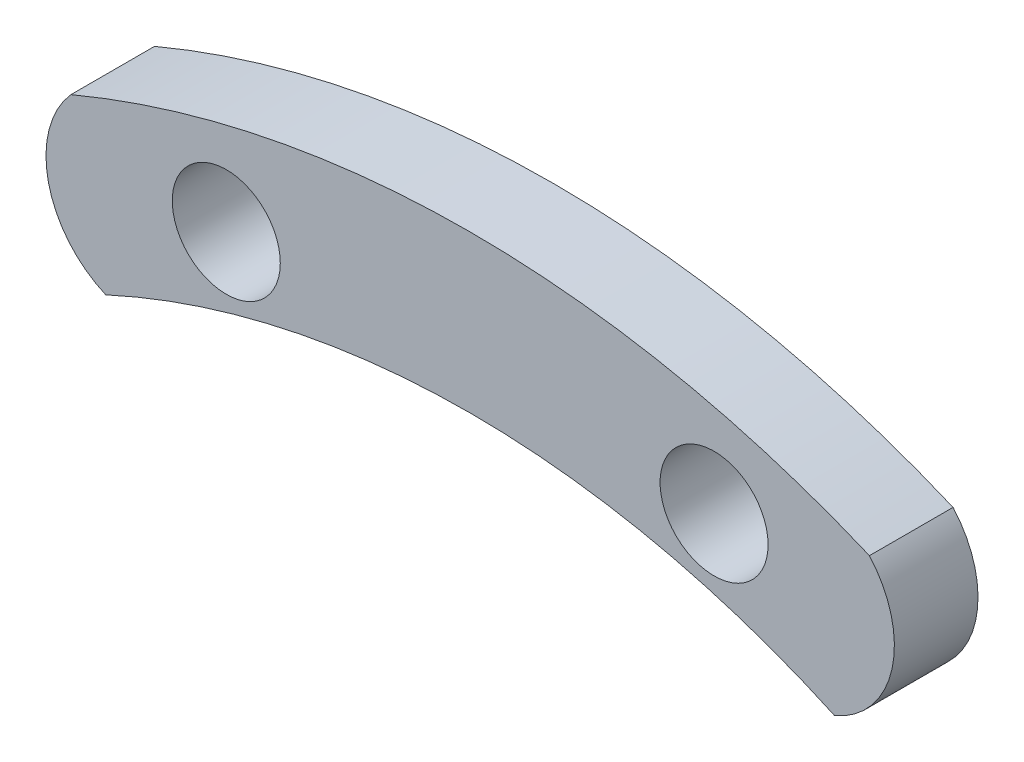
ISO-10303-21;
HEADER;
FILE_DESCRIPTION(('STEP AP214'),'2;1');
FILE_NAME('part.step','',(''),(''),'','','');
FILE_SCHEMA(('AUTOMOTIVE_DESIGN { 1 0 10303 214 1 1 1 1 }'));
ENDSEC;
DATA;
#1=APPLICATION_CONTEXT('core data for automotive mechanical design processes');
#2=APPLICATION_PROTOCOL_DEFINITION('international standard','automotive_design',2000,#1);
#3=PRODUCT_CONTEXT('',#1,'mechanical');
#4=PRODUCT('Part','Part','',(#3));
#5=PRODUCT_RELATED_PRODUCT_CATEGORY('part','',(#4));
#6=PRODUCT_DEFINITION_FORMATION('','',#4);
#7=PRODUCT_DEFINITION_CONTEXT('part definition',#1,'design');
#8=PRODUCT_DEFINITION('design','',#6,#7);
#9=PRODUCT_DEFINITION_SHAPE('','',#8);
#10=(LENGTH_UNIT() NAMED_UNIT(*) SI_UNIT(.MILLI.,.METRE.));
#11=(NAMED_UNIT(*) PLANE_ANGLE_UNIT() SI_UNIT($,.RADIAN.));
#12=(NAMED_UNIT(*) SI_UNIT($,.STERADIAN.) SOLID_ANGLE_UNIT());
#13=UNCERTAINTY_MEASURE_WITH_UNIT(LENGTH_MEASURE(1.E-05),#10,'distance_accuracy_value','');
#14=(GEOMETRIC_REPRESENTATION_CONTEXT(3) GLOBAL_UNCERTAINTY_ASSIGNED_CONTEXT((#13)) GLOBAL_UNIT_ASSIGNED_CONTEXT((#10,
#11,#12)) REPRESENTATION_CONTEXT('',''));
#15=CARTESIAN_POINT('',(0.,0.,0.));
#16=DIRECTION('',(0.,0.,1.));
#17=DIRECTION('',(1.,0.,0.));
#18=AXIS2_PLACEMENT_3D('',#15,#16,#17);
#19=CARTESIAN_POINT('',(-11.8743529349079,32.1369409329228,6.096));
#20=DIRECTION('',(0.,0.,1.));
#21=DIRECTION('',(1.,0.,0.));
#22=AXIS2_PLACEMENT_3D('',#19,#20,#21);
#23=PLANE('',#22);
#24=CARTESIAN_POINT('',(-17.78,66.04,6.096));
#25=DIRECTION('',(0.,0.,1.));
#26=DIRECTION('',(1.,0.,0.));
#27=AXIS2_PLACEMENT_3D('',#24,#25,#26);
#28=CIRCLE('',#27,3.937);
#29=CARTESIAN_POINT('',(-13.843,66.04,6.096));
#30=VERTEX_POINT('',#29);
#31=EDGE_CURVE('E100',#30,#30,#28,.T.);
#32=ORIENTED_EDGE('',*,*,#31,.F.);
#33=EDGE_LOOP('',(#32));
#34=FACE_BOUND('',#33,.T.);
#35=CARTESIAN_POINT('',(-23.7487058698158,64.2738818658455,6.096));
#36=DIRECTION('',(0.,0.,1.));
#37=DIRECTION('',(1.,0.,0.));
#38=AXIS2_PLACEMENT_3D('',#35,#36,#37);
#39=CIRCLE('',#38,7.17399122242576);
#40=CARTESIAN_POINT('',(-29.1049156924743,69.04642483528,6.096));
#41=VERTEX_POINT('',#40);
#42=CARTESIAN_POINT('',(-26.5655124405533,57.6760223036472,6.096));
#43=VERTEX_POINT('',#42);
#44=EDGE_CURVE('E85',#41,#43,#39,.T.);
#45=ORIENTED_EDGE('',*,*,#44,.T.);
#46=CARTESIAN_POINT('',(0.,0.,6.096));
#47=DIRECTION('',(0.,0.,-1.));
#48=DIRECTION('',(1.,0.,0.));
#49=AXIS2_PLACEMENT_3D('',#46,#47,#48);
#50=CIRCLE('',#49,63.5);
#51=CARTESIAN_POINT('',(26.5655124405533,57.6760223036472,6.096));
#52=VERTEX_POINT('',#51);
#53=EDGE_CURVE('E80',#43,#52,#50,.T.);
#54=ORIENTED_EDGE('',*,*,#53,.T.);
#55=CARTESIAN_POINT('',(23.7487058698158,64.2738818658455,6.096));
#56=DIRECTION('',(0.,0.,1.));
#57=DIRECTION('',(-1.,0.,0.));
#58=AXIS2_PLACEMENT_3D('',#55,#56,#57);
#59=CIRCLE('',#58,7.17399122242576);
#60=CARTESIAN_POINT('',(29.1049156924743,69.04642483528,6.096));
#61=VERTEX_POINT('',#60);
#62=EDGE_CURVE('E83',#52,#61,#59,.T.);
#63=ORIENTED_EDGE('',*,*,#62,.T.);
#64=CARTESIAN_POINT('',(0.,0.,6.096));
#65=DIRECTION('',(0.,0.,1.));
#66=DIRECTION('',(1.,0.,0.));
#67=AXIS2_PLACEMENT_3D('',#64,#65,#66);
#68=CIRCLE('',#67,74.93);
#69=EDGE_CURVE('E50',#61,#41,#68,.T.);
#70=ORIENTED_EDGE('',*,*,#69,.T.);
#71=EDGE_LOOP('',(#45,#54,#63,#70));
#72=FACE_BOUND('',#71,.T.);
#73=CARTESIAN_POINT('',(17.78,66.04,6.096));
#74=DIRECTION('',(0.,0.,1.));
#75=DIRECTION('',(1.,0.,0.));
#76=AXIS2_PLACEMENT_3D('',#73,#74,#75);
#77=CIRCLE('',#76,3.937);
#78=CARTESIAN_POINT('',(21.717,66.04,6.096));
#79=VERTEX_POINT('',#78);
#80=EDGE_CURVE('E115',#79,#79,#77,.T.);
#81=ORIENTED_EDGE('',*,*,#80,.F.);
#82=EDGE_LOOP('',(#81));
#83=FACE_BOUND('',#82,.T.);
#84=ADVANCED_FACE('F33',(#34,#72,#83),#23,.T.);
#85=CARTESIAN_POINT('',(-11.8743529349079,32.1369409329228,0.));
#86=DIRECTION('',(0.,0.,1.));
#87=DIRECTION('',(1.,0.,0.));
#88=AXIS2_PLACEMENT_3D('',#85,#86,#87);
#89=PLANE('',#88);
#90=CARTESIAN_POINT('',(-23.7487058698158,64.2738818658455,0.));
#91=DIRECTION('',(0.,0.,1.));
#92=DIRECTION('',(1.,0.,0.));
#93=AXIS2_PLACEMENT_3D('',#90,#91,#92);
#94=CIRCLE('',#93,7.17399122242576);
#95=CARTESIAN_POINT('',(-29.1049156924743,69.04642483528,0.));
#96=VERTEX_POINT('',#95);
#97=CARTESIAN_POINT('',(-26.5655124405533,57.6760223036472,0.));
#98=VERTEX_POINT('',#97);
#99=EDGE_CURVE('E97',#96,#98,#94,.T.);
#100=ORIENTED_EDGE('',*,*,#99,.F.);
#101=CARTESIAN_POINT('',(0.,0.,0.));
#102=DIRECTION('',(0.,0.,1.));
#103=DIRECTION('',(1.,0.,0.));
#104=AXIS2_PLACEMENT_3D('',#101,#102,#103);
#105=CIRCLE('',#104,74.93);
#106=CARTESIAN_POINT('',(29.1049156924743,69.04642483528,0.));
#107=VERTEX_POINT('',#106);
#108=EDGE_CURVE('E73',#107,#96,#105,.T.);
#109=ORIENTED_EDGE('',*,*,#108,.F.);
#110=CARTESIAN_POINT('',(23.7487058698158,64.2738818658455,0.));
#111=DIRECTION('',(0.,0.,1.));
#112=DIRECTION('',(-1.,0.,0.));
#113=AXIS2_PLACEMENT_3D('',#110,#111,#112);
#114=CIRCLE('',#113,7.17399122242576);
#115=CARTESIAN_POINT('',(26.5655124405533,57.6760223036472,0.));
#116=VERTEX_POINT('',#115);
#117=EDGE_CURVE('E67',#116,#107,#114,.T.);
#118=ORIENTED_EDGE('',*,*,#117,.F.);
#119=CARTESIAN_POINT('',(0.,0.,0.));
#120=DIRECTION('',(0.,0.,-1.));
#121=DIRECTION('',(1.,0.,0.));
#122=AXIS2_PLACEMENT_3D('',#119,#120,#121);
#123=CIRCLE('',#122,63.5);
#124=EDGE_CURVE('E89',#98,#116,#123,.T.);
#125=ORIENTED_EDGE('',*,*,#124,.F.);
#126=EDGE_LOOP('',(#100,#109,#118,#125));
#127=FACE_BOUND('',#126,.T.);
#128=CARTESIAN_POINT('',(-17.78,66.04,0.));
#129=DIRECTION('',(0.,0.,1.));
#130=DIRECTION('',(1.,0.,0.));
#131=AXIS2_PLACEMENT_3D('',#128,#129,#130);
#132=CIRCLE('',#131,3.937);
#133=CARTESIAN_POINT('',(-13.843,66.04,0.));
#134=VERTEX_POINT('',#133);
#135=EDGE_CURVE('E112',#134,#134,#132,.T.);
#136=ORIENTED_EDGE('',*,*,#135,.T.);
#137=EDGE_LOOP('',(#136));
#138=FACE_BOUND('',#137,.T.);
#139=CARTESIAN_POINT('',(17.78,66.04,0.));
#140=DIRECTION('',(0.,0.,1.));
#141=DIRECTION('',(1.,0.,0.));
#142=AXIS2_PLACEMENT_3D('',#139,#140,#141);
#143=CIRCLE('',#142,3.937);
#144=CARTESIAN_POINT('',(21.717,66.04,0.));
#145=VERTEX_POINT('',#144);
#146=EDGE_CURVE('E118',#145,#145,#143,.T.);
#147=ORIENTED_EDGE('',*,*,#146,.T.);
#148=EDGE_LOOP('',(#147));
#149=FACE_BOUND('',#148,.T.);
#150=ADVANCED_FACE('F108',(#127,#138,#149),#89,.F.);
#151=CARTESIAN_POINT('',(-23.7487058698158,64.2738818658455,6.096));
#152=DIRECTION('',(0.,0.,-1.));
#153=DIRECTION('',(-1.,0.,0.));
#154=AXIS2_PLACEMENT_3D('',#151,#152,#153);
#155=CYLINDRICAL_SURFACE('',#154,7.17399122242576);
#156=ORIENTED_EDGE('',*,*,#99,.T.);
#157=DIRECTION('',(0.,0.,-1.));
#158=VECTOR('',#157,1.);
#159=CARTESIAN_POINT('',(-26.5655124405533,57.6760223036472,6.096));
#160=LINE('',#159,#158);
#161=EDGE_CURVE('E11',#43,#98,#160,.T.);
#162=ORIENTED_EDGE('',*,*,#161,.F.);
#163=ORIENTED_EDGE('',*,*,#44,.F.);
#164=DIRECTION('',(0.,0.,-1.));
#165=VECTOR('',#164,1.);
#166=CARTESIAN_POINT('',(-29.1049156924743,69.04642483528,6.096));
#167=LINE('',#166,#165);
#168=EDGE_CURVE('E93',#41,#96,#167,.T.);
#169=ORIENTED_EDGE('',*,*,#168,.T.);
#170=EDGE_LOOP('',(#156,#162,#163,#169));
#171=FACE_BOUND('',#170,.T.);
#172=ADVANCED_FACE('F35',(#171),#155,.T.);
#173=CARTESIAN_POINT('',(0.,0.,6.096));
#174=DIRECTION('',(0.,0.,-1.));
#175=DIRECTION('',(-1.,0.,0.));
#176=AXIS2_PLACEMENT_3D('',#173,#174,#175);
#177=CYLINDRICAL_SURFACE('',#176,63.5);
#178=ORIENTED_EDGE('',*,*,#124,.T.);
#179=DIRECTION('',(0.,0.,-1.));
#180=VECTOR('',#179,1.);
#181=CARTESIAN_POINT('',(26.5655124405533,57.6760223036472,6.096));
#182=LINE('',#181,#180);
#183=EDGE_CURVE('E42',#52,#116,#182,.T.);
#184=ORIENTED_EDGE('',*,*,#183,.F.);
#185=ORIENTED_EDGE('',*,*,#53,.F.);
#186=ORIENTED_EDGE('',*,*,#161,.T.);
#187=EDGE_LOOP('',(#178,#184,#185,#186));
#188=FACE_BOUND('',#187,.T.);
#189=ADVANCED_FACE('F88',(#188),#177,.F.);
#190=CARTESIAN_POINT('',(23.7487058698158,64.2738818658455,6.096));
#191=DIRECTION('',(0.,0.,-1.));
#192=DIRECTION('',(-1.,0.,0.));
#193=AXIS2_PLACEMENT_3D('',#190,#191,#192);
#194=CYLINDRICAL_SURFACE('',#193,7.17399122242576);
#195=ORIENTED_EDGE('',*,*,#117,.T.);
#196=DIRECTION('',(0.,0.,-1.));
#197=VECTOR('',#196,1.);
#198=CARTESIAN_POINT('',(29.1049156924743,69.04642483528,6.096));
#199=LINE('',#198,#197);
#200=EDGE_CURVE('E90',#61,#107,#199,.T.);
#201=ORIENTED_EDGE('',*,*,#200,.F.);
#202=ORIENTED_EDGE('',*,*,#62,.F.);
#203=ORIENTED_EDGE('',*,*,#183,.T.);
#204=EDGE_LOOP('',(#195,#201,#202,#203));
#205=FACE_BOUND('',#204,.T.);
#206=ADVANCED_FACE('F91',(#205),#194,.T.);
#207=CARTESIAN_POINT('',(0.,0.,6.096));
#208=DIRECTION('',(0.,0.,-1.));
#209=DIRECTION('',(-1.,0.,0.));
#210=AXIS2_PLACEMENT_3D('',#207,#208,#209);
#211=CYLINDRICAL_SURFACE('',#210,74.93);
#212=ORIENTED_EDGE('',*,*,#108,.T.);
#213=ORIENTED_EDGE('',*,*,#168,.F.);
#214=ORIENTED_EDGE('',*,*,#69,.F.);
#215=ORIENTED_EDGE('',*,*,#200,.T.);
#216=EDGE_LOOP('',(#212,#213,#214,#215));
#217=FACE_BOUND('',#216,.T.);
#218=ADVANCED_FACE('F105',(#217),#211,.T.);
#219=CARTESIAN_POINT('',(-17.78,66.04,6.096));
#220=DIRECTION('',(0.,0.,-1.));
#221=DIRECTION('',(-1.,0.,0.));
#222=AXIS2_PLACEMENT_3D('',#219,#220,#221);
#223=CYLINDRICAL_SURFACE('',#222,3.937);
#224=ORIENTED_EDGE('',*,*,#31,.T.);
#225=EDGE_LOOP('',(#224));
#226=FACE_BOUND('',#225,.T.);
#227=ORIENTED_EDGE('',*,*,#135,.F.);
#228=EDGE_LOOP('',(#227));
#229=FACE_BOUND('',#228,.T.);
#230=ADVANCED_FACE('F135',(#226,#229),#223,.F.);
#231=CARTESIAN_POINT('',(17.78,66.04,6.096));
#232=DIRECTION('',(0.,0.,-1.));
#233=DIRECTION('',(-1.,0.,0.));
#234=AXIS2_PLACEMENT_3D('',#231,#232,#233);
#235=CYLINDRICAL_SURFACE('',#234,3.937);
#236=ORIENTED_EDGE('',*,*,#80,.T.);
#237=EDGE_LOOP('',(#236));
#238=FACE_BOUND('',#237,.T.);
#239=ORIENTED_EDGE('',*,*,#146,.F.);
#240=EDGE_LOOP('',(#239));
#241=FACE_BOUND('',#240,.T.);
#242=ADVANCED_FACE('F124',(#238,#241),#235,.F.);
#243=CLOSED_SHELL('',(#84,#150,#172,#189,#206,#218,#230,#242));
#244=MANIFOLD_SOLID_BREP('B2',#243);
#245=ADVANCED_BREP_SHAPE_REPRESENTATION('',(#18,#244),#14);
#246=SHAPE_DEFINITION_REPRESENTATION(#9,#245);
ENDSEC;
END-ISO-10303-21;
